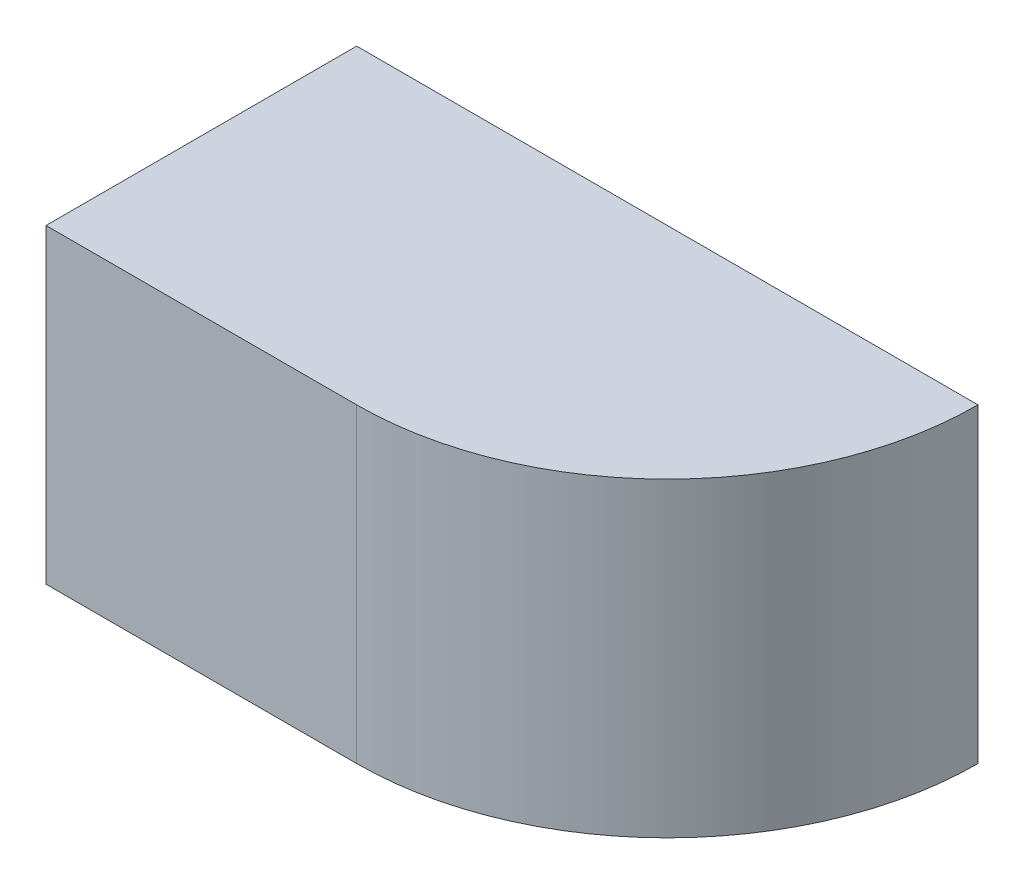
ISO-10303-21;
HEADER;
FILE_DESCRIPTION(('STEP AP214'),'2;1');
FILE_NAME('part.step','',(''),(''),'','','');
FILE_SCHEMA(('AUTOMOTIVE_DESIGN { 1 0 10303 214 1 1 1 1 }'));
ENDSEC;
DATA;
#1=APPLICATION_CONTEXT('core data for automotive mechanical design processes');
#2=APPLICATION_PROTOCOL_DEFINITION('international standard','automotive_design',2000,#1);
#3=PRODUCT_CONTEXT('',#1,'mechanical');
#4=PRODUCT('Part','Part','',(#3));
#5=PRODUCT_RELATED_PRODUCT_CATEGORY('part','',(#4));
#6=PRODUCT_DEFINITION_FORMATION('','',#4);
#7=PRODUCT_DEFINITION_CONTEXT('part definition',#1,'design');
#8=PRODUCT_DEFINITION('design','',#6,#7);
#9=PRODUCT_DEFINITION_SHAPE('','',#8);
#10=(LENGTH_UNIT() NAMED_UNIT(*) SI_UNIT(.MILLI.,.METRE.));
#11=(NAMED_UNIT(*) PLANE_ANGLE_UNIT() SI_UNIT($,.RADIAN.));
#12=(NAMED_UNIT(*) SI_UNIT($,.STERADIAN.) SOLID_ANGLE_UNIT());
#13=UNCERTAINTY_MEASURE_WITH_UNIT(LENGTH_MEASURE(1.E-05),#10,'distance_accuracy_value','');
#14=(GEOMETRIC_REPRESENTATION_CONTEXT(3) GLOBAL_UNCERTAINTY_ASSIGNED_CONTEXT((#13)) GLOBAL_UNIT_ASSIGNED_CONTEXT((#10,
#11,#12)) REPRESENTATION_CONTEXT('',''));
#15=CARTESIAN_POINT('',(0.,0.,0.));
#16=DIRECTION('',(0.,0.,1.));
#17=DIRECTION('',(1.,0.,0.));
#18=AXIS2_PLACEMENT_3D('',#15,#16,#17);
#19=CARTESIAN_POINT('',(2.00000002980232,-6.75000013038516,2.));
#20=DIRECTION('',(0.,0.,1.));
#21=DIRECTION('',(1.,0.,0.));
#22=AXIS2_PLACEMENT_3D('',#19,#20,#21);
#23=PLANE('',#22);
#24=DIRECTION('',(0.,-1.,0.));
#25=VECTOR('',#24,1.);
#26=CARTESIAN_POINT('',(1.50000002235174,-6.50000012665987,2.));
#27=LINE('',#26,#25);
#28=CARTESIAN_POINT('',(1.50000002235174,-6.50000012665987,2.));
#29=VERTEX_POINT('',#28);
#30=CARTESIAN_POINT('',(1.50000002235174,-7.00000013411045,2.));
#31=VERTEX_POINT('',#30);
#32=EDGE_CURVE('E11',#29,#31,#27,.T.);
#33=ORIENTED_EDGE('',*,*,#32,.F.);
#34=DIRECTION('',(-1.,0.,0.));
#35=VECTOR('',#34,1.);
#36=CARTESIAN_POINT('',(2.5000000372529,-6.50000012665987,2.));
#37=LINE('',#36,#35);
#38=CARTESIAN_POINT('',(2.5000000372529,-6.50000012665987,2.));
#39=VERTEX_POINT('',#38);
#40=EDGE_CURVE('E86',#39,#29,#37,.T.);
#41=ORIENTED_EDGE('',*,*,#40,.F.);
#42=DIRECTION('',(0.,1.,0.));
#43=VECTOR('',#42,1.);
#44=CARTESIAN_POINT('',(2.5000000372529,-7.00000013411045,2.));
#45=LINE('',#44,#43);
#46=CARTESIAN_POINT('',(2.5000000372529,-7.00000013411045,2.));
#47=VERTEX_POINT('',#46);
#48=EDGE_CURVE('E95',#47,#39,#45,.T.);
#49=ORIENTED_EDGE('',*,*,#48,.F.);
#50=DIRECTION('',(1.,0.,0.));
#51=VECTOR('',#50,1.);
#52=CARTESIAN_POINT('',(1.50000002235174,-7.00000013411045,2.));
#53=LINE('',#52,#51);
#54=EDGE_CURVE('E27',#31,#47,#53,.T.);
#55=ORIENTED_EDGE('',*,*,#54,.F.);
#56=EDGE_LOOP('',(#33,#41,#49,#55));
#57=FACE_BOUND('',#56,.T.);
#58=ADVANCED_FACE('F17',(#57),#23,.F.);
#59=CARTESIAN_POINT('',(1.50000002235174,-6.50000012665987,2.));
#60=DIRECTION('',(-1.,0.,0.));
#61=DIRECTION('',(0.,0.,1.));
#62=AXIS2_PLACEMENT_3D('',#59,#60,#61);
#63=PLANE('',#62);
#64=ORIENTED_EDGE('',*,*,#32,.T.);
#65=DIRECTION('',(0.,0.,1.));
#66=VECTOR('',#65,1.);
#67=CARTESIAN_POINT('',(1.50000002235174,-7.00000013411045,2.));
#68=LINE('',#67,#66);
#69=CARTESIAN_POINT('',(1.50000002235174,-7.00000013411045,2.5));
#70=VERTEX_POINT('',#69);
#71=EDGE_CURVE('E75',#31,#70,#68,.T.);
#72=ORIENTED_EDGE('',*,*,#71,.T.);
#73=DIRECTION('',(0.,-1.,0.));
#74=VECTOR('',#73,1.);
#75=CARTESIAN_POINT('',(1.50000002235174,-6.50000012665987,2.5));
#76=LINE('',#75,#74);
#77=CARTESIAN_POINT('',(1.50000002235174,-6.50000012665987,2.5));
#78=VERTEX_POINT('',#77);
#79=EDGE_CURVE('E77',#78,#70,#76,.T.);
#80=ORIENTED_EDGE('',*,*,#79,.F.);
#81=DIRECTION('',(0.,0.,1.));
#82=VECTOR('',#81,1.);
#83=CARTESIAN_POINT('',(1.50000002235174,-6.50000012665987,2.));
#84=LINE('',#83,#82);
#85=EDGE_CURVE('E80',#29,#78,#84,.T.);
#86=ORIENTED_EDGE('',*,*,#85,.F.);
#87=EDGE_LOOP('',(#64,#72,#80,#86));
#88=FACE_BOUND('',#87,.T.);
#89=ADVANCED_FACE('F76',(#88),#63,.T.);
#90=CARTESIAN_POINT('',(1.50000002235174,-7.00000013411045,2.));
#91=DIRECTION('',(0.,-1.,0.));
#92=DIRECTION('',(0.,0.,-1.));
#93=AXIS2_PLACEMENT_3D('',#90,#91,#92);
#94=PLANE('',#93);
#95=CARTESIAN_POINT('',(2.0000000372529,-7.00000013411045,2.));
#96=DIRECTION('',(0.,1.,0.));
#97=DIRECTION('',(0.707106781186548,0.,0.707106781186548));
#98=AXIS2_PLACEMENT_3D('',#95,#96,#97);
#99=CIRCLE('',#98,0.5);
#100=CARTESIAN_POINT('',(2.0000000372529,-7.00000013411045,2.5));
#101=VERTEX_POINT('',#100);
#102=EDGE_CURVE('E83',#101,#47,#99,.T.);
#103=ORIENTED_EDGE('',*,*,#102,.F.);
#104=DIRECTION('',(1.,0.,0.));
#105=VECTOR('',#104,1.);
#106=CARTESIAN_POINT('',(1.50000002235174,-7.00000013411045,2.5));
#107=LINE('',#106,#105);
#108=EDGE_CURVE('E58',#70,#101,#107,.T.);
#109=ORIENTED_EDGE('',*,*,#108,.F.);
#110=ORIENTED_EDGE('',*,*,#71,.F.);
#111=ORIENTED_EDGE('',*,*,#54,.T.);
#112=EDGE_LOOP('',(#103,#109,#110,#111));
#113=FACE_BOUND('',#112,.T.);
#114=ADVANCED_FACE('F81',(#113),#94,.T.);
#115=CARTESIAN_POINT('',(2.5000000372529,-6.50000012665987,2.));
#116=DIRECTION('',(0.,1.,0.));
#117=DIRECTION('',(1.,0.,0.));
#118=AXIS2_PLACEMENT_3D('',#115,#116,#117);
#119=PLANE('',#118);
#120=CARTESIAN_POINT('',(2.0000000372529,-6.50000012665987,2.));
#121=DIRECTION('',(0.,-1.,0.));
#122=DIRECTION('',(0.707106781186548,0.,0.707106781186548));
#123=AXIS2_PLACEMENT_3D('',#120,#121,#122);
#124=CIRCLE('',#123,0.5);
#125=CARTESIAN_POINT('',(2.0000000372529,-6.50000012665987,2.5));
#126=VERTEX_POINT('',#125);
#127=EDGE_CURVE('E20',#39,#126,#124,.T.);
#128=ORIENTED_EDGE('',*,*,#127,.F.);
#129=ORIENTED_EDGE('',*,*,#40,.T.);
#130=ORIENTED_EDGE('',*,*,#85,.T.);
#131=DIRECTION('',(-1.,0.,0.));
#132=VECTOR('',#131,1.);
#133=CARTESIAN_POINT('',(2.5000000372529,-6.50000012665987,2.5));
#134=LINE('',#133,#132);
#135=EDGE_CURVE('E89',#126,#78,#134,.T.);
#136=ORIENTED_EDGE('',*,*,#135,.F.);
#137=EDGE_LOOP('',(#128,#129,#130,#136));
#138=FACE_BOUND('',#137,.T.);
#139=ADVANCED_FACE('F127',(#138),#119,.T.);
#140=CARTESIAN_POINT('',(2.00000002980232,-6.75000013038516,2.5));
#141=DIRECTION('',(0.,0.,1.));
#142=DIRECTION('',(1.,0.,0.));
#143=AXIS2_PLACEMENT_3D('',#140,#141,#142);
#144=PLANE('',#143);
#145=DIRECTION('',(0.,-1.,0.));
#146=VECTOR('',#145,1.);
#147=CARTESIAN_POINT('',(2.0000000372529,-6.87500013224781,2.5));
#148=LINE('',#147,#146);
#149=EDGE_CURVE('E100',#126,#101,#148,.T.);
#150=ORIENTED_EDGE('',*,*,#149,.F.);
#151=ORIENTED_EDGE('',*,*,#135,.T.);
#152=ORIENTED_EDGE('',*,*,#79,.T.);
#153=ORIENTED_EDGE('',*,*,#108,.T.);
#154=EDGE_LOOP('',(#150,#151,#152,#153));
#155=FACE_BOUND('',#154,.T.);
#156=ADVANCED_FACE('F88',(#155),#144,.T.);
#157=CARTESIAN_POINT('',(2.0000000372529,-6.87500013224781,2.));
#158=DIRECTION('',(0.,1.,0.));
#159=DIRECTION('',(0.707106781186548,0.,0.707106781186548));
#160=AXIS2_PLACEMENT_3D('',#157,#158,#159);
#161=CYLINDRICAL_SURFACE('',#160,0.5);
#162=ORIENTED_EDGE('',*,*,#127,.T.);
#163=ORIENTED_EDGE('',*,*,#149,.T.);
#164=ORIENTED_EDGE('',*,*,#102,.T.);
#165=ORIENTED_EDGE('',*,*,#48,.T.);
#166=EDGE_LOOP('',(#162,#163,#164,#165));
#167=FACE_BOUND('',#166,.T.);
#168=ADVANCED_FACE('F114',(#167),#161,.T.);
#169=CLOSED_SHELL('',(#58,#89,#114,#139,#156,#168));
#170=MANIFOLD_SOLID_BREP('B1',#169);
#171=ADVANCED_BREP_SHAPE_REPRESENTATION('',(#18,#170),#14);
#172=SHAPE_DEFINITION_REPRESENTATION(#9,#171);
ENDSEC;
END-ISO-10303-21;
